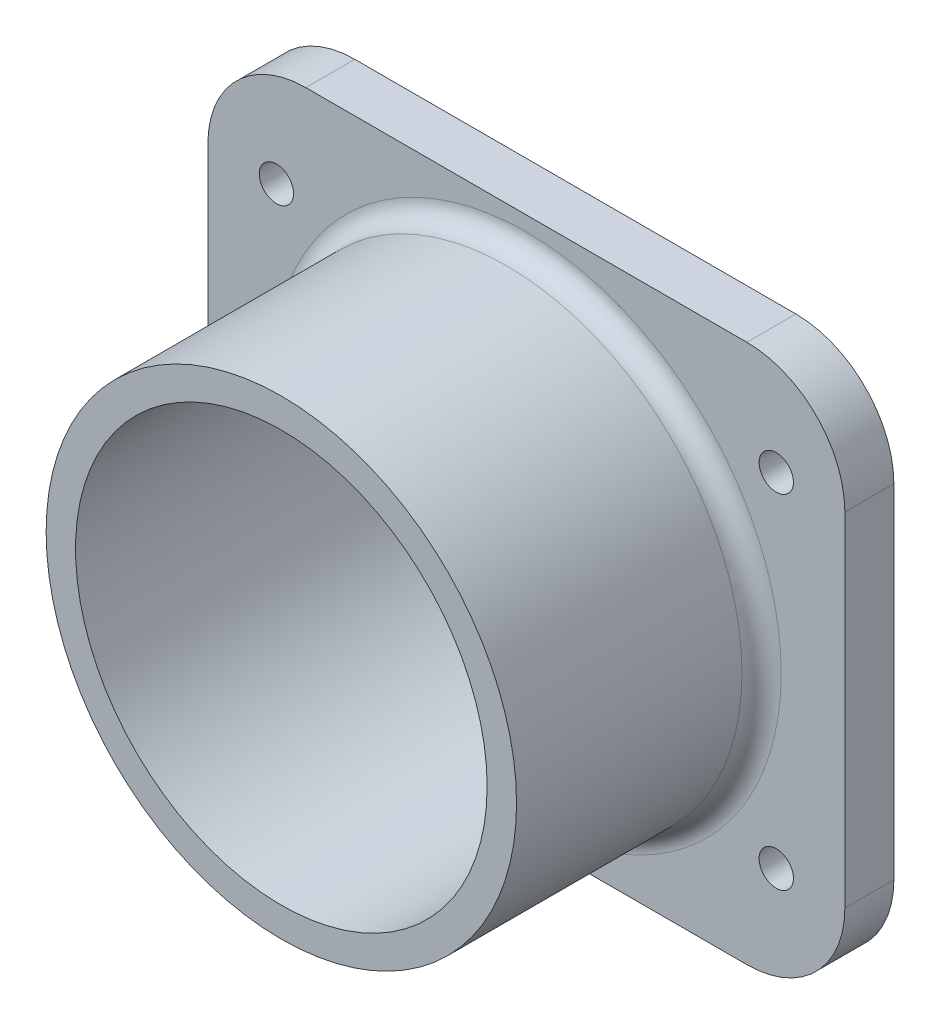
ISO-10303-21;
HEADER;
FILE_DESCRIPTION(('STEP AP214'),'2;1');
FILE_NAME('part.step','',(''),(''),'','','');
FILE_SCHEMA(('AUTOMOTIVE_DESIGN { 1 0 10303 214 1 1 1 1 }'));
ENDSEC;
DATA;
#1=APPLICATION_CONTEXT('core data for automotive mechanical design processes');
#2=APPLICATION_PROTOCOL_DEFINITION('international standard','automotive_design',2000,#1);
#3=PRODUCT_CONTEXT('',#1,'mechanical');
#4=PRODUCT('Part','Part','',(#3));
#5=PRODUCT_RELATED_PRODUCT_CATEGORY('part','',(#4));
#6=PRODUCT_DEFINITION_FORMATION('','',#4);
#7=PRODUCT_DEFINITION_CONTEXT('part definition',#1,'design');
#8=PRODUCT_DEFINITION('design','',#6,#7);
#9=PRODUCT_DEFINITION_SHAPE('','',#8);
#10=(LENGTH_UNIT() NAMED_UNIT(*) SI_UNIT(.MILLI.,.METRE.));
#11=(NAMED_UNIT(*) PLANE_ANGLE_UNIT() SI_UNIT($,.RADIAN.));
#12=(NAMED_UNIT(*) SI_UNIT($,.STERADIAN.) SOLID_ANGLE_UNIT());
#13=UNCERTAINTY_MEASURE_WITH_UNIT(LENGTH_MEASURE(1.E-05),#10,'distance_accuracy_value','');
#14=(GEOMETRIC_REPRESENTATION_CONTEXT(3) GLOBAL_UNCERTAINTY_ASSIGNED_CONTEXT((#13)) GLOBAL_UNIT_ASSIGNED_CONTEXT((#10,
#11,#12)) REPRESENTATION_CONTEXT('',''));
#15=CARTESIAN_POINT('',(0.,0.,0.));
#16=DIRECTION('',(0.,0.,1.));
#17=DIRECTION('',(1.,0.,0.));
#18=AXIS2_PLACEMENT_3D('',#15,#16,#17);
#19=CARTESIAN_POINT('',(0.,0.,5.));
#20=DIRECTION('',(0.,0.,1.));
#21=DIRECTION('',(1.,0.,0.));
#22=AXIS2_PLACEMENT_3D('',#19,#20,#21);
#23=PLANE('',#22);
#24=CARTESIAN_POINT('',(0.,0.,5.));
#25=DIRECTION('',(0.,0.,1.));
#26=DIRECTION('',(1.,0.,0.));
#27=AXIS2_PLACEMENT_3D('',#24,#25,#26);
#28=CIRCLE('',#27,26.);
#29=CARTESIAN_POINT('',(26.,0.,5.));
#30=VERTEX_POINT('',#29);
#31=EDGE_CURVE('E11',#30,#30,#28,.F.);
#32=ORIENTED_EDGE('',*,*,#31,.T.);
#33=EDGE_LOOP('',(#32));
#34=FACE_BOUND('',#33,.T.);
#35=CARTESIAN_POINT('',(-25.5,17.5,5.));
#36=DIRECTION('',(0.,0.,1.));
#37=DIRECTION('',(-1.,0.,0.));
#38=AXIS2_PLACEMENT_3D('',#35,#36,#37);
#39=CIRCLE('',#38,1.75);
#40=CARTESIAN_POINT('',(-27.25,17.5,5.));
#41=VERTEX_POINT('',#40);
#42=EDGE_CURVE('E168',#41,#41,#39,.T.);
#43=ORIENTED_EDGE('',*,*,#42,.F.);
#44=EDGE_LOOP('',(#43));
#45=FACE_BOUND('',#44,.T.);
#46=CARTESIAN_POINT('',(25.5,17.5,5.));
#47=DIRECTION('',(0.,0.,1.));
#48=DIRECTION('',(1.,0.,0.));
#49=AXIS2_PLACEMENT_3D('',#46,#47,#48);
#50=CIRCLE('',#49,1.75);
#51=CARTESIAN_POINT('',(27.25,17.5,5.));
#52=VERTEX_POINT('',#51);
#53=EDGE_CURVE('E288',#52,#52,#50,.T.);
#54=ORIENTED_EDGE('',*,*,#53,.F.);
#55=EDGE_LOOP('',(#54));
#56=FACE_BOUND('',#55,.T.);
#57=CARTESIAN_POINT('',(25.5,-17.5,5.));
#58=DIRECTION('',(0.,0.,1.));
#59=DIRECTION('',(-1.,0.,0.));
#60=AXIS2_PLACEMENT_3D('',#57,#58,#59);
#61=CIRCLE('',#60,1.75);
#62=CARTESIAN_POINT('',(23.75,-17.5,5.));
#63=VERTEX_POINT('',#62);
#64=EDGE_CURVE('E285',#63,#63,#61,.T.);
#65=ORIENTED_EDGE('',*,*,#64,.F.);
#66=EDGE_LOOP('',(#65));
#67=FACE_BOUND('',#66,.T.);
#68=CARTESIAN_POINT('',(-25.5,-17.5,5.));
#69=DIRECTION('',(0.,0.,1.));
#70=DIRECTION('',(1.,0.,0.));
#71=AXIS2_PLACEMENT_3D('',#68,#69,#70);
#72=CIRCLE('',#71,1.75);
#73=CARTESIAN_POINT('',(-23.75,-17.5,5.));
#74=VERTEX_POINT('',#73);
#75=EDGE_CURVE('E163',#74,#74,#72,.T.);
#76=ORIENTED_EDGE('',*,*,#75,.F.);
#77=EDGE_LOOP('',(#76));
#78=FACE_BOUND('',#77,.T.);
#79=DIRECTION('',(0.,-1.,0.));
#80=VECTOR('',#79,1.);
#81=CARTESIAN_POINT('',(32.5,-27.5,5.));
#82=LINE('',#81,#80);
#83=CARTESIAN_POINT('',(32.5,17.5,5.));
#84=VERTEX_POINT('',#83);
#85=CARTESIAN_POINT('',(32.5,-17.5,5.));
#86=VERTEX_POINT('',#85);
#87=EDGE_CURVE('E122',#84,#86,#82,.T.);
#88=ORIENTED_EDGE('',*,*,#87,.F.);
#89=CARTESIAN_POINT('',(22.5,17.5,5.));
#90=DIRECTION('',(0.,0.,1.));
#91=DIRECTION('',(1.,0.,0.));
#92=AXIS2_PLACEMENT_3D('',#89,#90,#91);
#93=CIRCLE('',#92,10.);
#94=CARTESIAN_POINT('',(22.5,27.5,5.));
#95=VERTEX_POINT('',#94);
#96=EDGE_CURVE('E149',#84,#95,#93,.T.);
#97=ORIENTED_EDGE('',*,*,#96,.T.);
#98=DIRECTION('',(1.,0.,0.));
#99=VECTOR('',#98,1.);
#100=CARTESIAN_POINT('',(-32.5,27.5,5.));
#101=LINE('',#100,#99);
#102=CARTESIAN_POINT('',(-22.5,27.5,5.));
#103=VERTEX_POINT('',#102);
#104=EDGE_CURVE('E129',#103,#95,#101,.T.);
#105=ORIENTED_EDGE('',*,*,#104,.F.);
#106=CARTESIAN_POINT('',(-22.5,17.5,5.));
#107=DIRECTION('',(0.,0.,1.));
#108=DIRECTION('',(1.,0.,0.));
#109=AXIS2_PLACEMENT_3D('',#106,#107,#108);
#110=CIRCLE('',#109,10.);
#111=CARTESIAN_POINT('',(-32.5,17.5,5.));
#112=VERTEX_POINT('',#111);
#113=EDGE_CURVE('E52',#103,#112,#110,.T.);
#114=ORIENTED_EDGE('',*,*,#113,.T.);
#115=DIRECTION('',(0.,1.,0.));
#116=VECTOR('',#115,1.);
#117=CARTESIAN_POINT('',(-32.5,-27.5,5.));
#118=LINE('',#117,#116);
#119=CARTESIAN_POINT('',(-32.5,-17.5,5.));
#120=VERTEX_POINT('',#119);
#121=EDGE_CURVE('E266',#120,#112,#118,.T.);
#122=ORIENTED_EDGE('',*,*,#121,.F.);
#123=CARTESIAN_POINT('',(-22.5,-17.5,5.));
#124=DIRECTION('',(0.,0.,1.));
#125=DIRECTION('',(1.,0.,0.));
#126=AXIS2_PLACEMENT_3D('',#123,#124,#125);
#127=CIRCLE('',#126,10.);
#128=CARTESIAN_POINT('',(-22.5,-27.5,5.));
#129=VERTEX_POINT('',#128);
#130=EDGE_CURVE('E145',#120,#129,#127,.T.);
#131=ORIENTED_EDGE('',*,*,#130,.T.);
#132=DIRECTION('',(-1.,0.,0.));
#133=VECTOR('',#132,1.);
#134=CARTESIAN_POINT('',(-32.5,-27.5,5.));
#135=LINE('',#134,#133);
#136=CARTESIAN_POINT('',(22.5,-27.5,5.));
#137=VERTEX_POINT('',#136);
#138=EDGE_CURVE('E263',#137,#129,#135,.T.);
#139=ORIENTED_EDGE('',*,*,#138,.F.);
#140=CARTESIAN_POINT('',(22.5,-17.5,5.));
#141=DIRECTION('',(0.,0.,1.));
#142=DIRECTION('',(1.,0.,0.));
#143=AXIS2_PLACEMENT_3D('',#140,#141,#142);
#144=CIRCLE('',#143,10.);
#145=EDGE_CURVE('E147',#137,#86,#144,.T.);
#146=ORIENTED_EDGE('',*,*,#145,.T.);
#147=EDGE_LOOP('',(#88,#97,#105,#114,#122,#131,#139,#146));
#148=FACE_BOUND('',#147,.T.);
#149=ADVANCED_FACE('F37',(#34,#45,#56,#67,#78,#148),#23,.T.);
#150=CARTESIAN_POINT('',(0.,0.,30.));
#151=DIRECTION('',(0.,0.,-1.));
#152=DIRECTION('',(-1.,0.,0.));
#153=AXIS2_PLACEMENT_3D('',#150,#151,#152);
#154=CYLINDRICAL_SURFACE('',#153,24.);
#155=CARTESIAN_POINT('',(0.,0.,7.));
#156=DIRECTION('',(0.,0.,1.));
#157=DIRECTION('',(1.,0.,0.));
#158=AXIS2_PLACEMENT_3D('',#155,#156,#157);
#159=CIRCLE('',#158,24.);
#160=CARTESIAN_POINT('',(24.,0.,7.));
#161=VERTEX_POINT('',#160);
#162=EDGE_CURVE('E45',#161,#161,#159,.T.);
#163=ORIENTED_EDGE('',*,*,#162,.T.);
#164=EDGE_LOOP('',(#163));
#165=FACE_BOUND('',#164,.T.);
#166=CARTESIAN_POINT('',(0.,0.,30.));
#167=DIRECTION('',(0.,0.,1.));
#168=DIRECTION('',(1.,0.,0.));
#169=AXIS2_PLACEMENT_3D('',#166,#167,#168);
#170=CIRCLE('',#169,24.);
#171=CARTESIAN_POINT('',(24.,0.,30.));
#172=VERTEX_POINT('',#171);
#173=EDGE_CURVE('E125',#172,#172,#170,.T.);
#174=ORIENTED_EDGE('',*,*,#173,.F.);
#175=EDGE_LOOP('',(#174));
#176=FACE_BOUND('',#175,.T.);
#177=ADVANCED_FACE('F176',(#165,#176),#154,.T.);
#178=CARTESIAN_POINT('',(0.,0.,30.));
#179=DIRECTION('',(0.,0.,1.));
#180=DIRECTION('',(1.,0.,0.));
#181=AXIS2_PLACEMENT_3D('',#178,#179,#180);
#182=PLANE('',#181);
#183=CARTESIAN_POINT('',(0.,0.,30.));
#184=DIRECTION('',(0.,0.,1.));
#185=DIRECTION('',(1.,0.,0.));
#186=AXIS2_PLACEMENT_3D('',#183,#184,#185);
#187=CIRCLE('',#186,21.);
#188=CARTESIAN_POINT('',(21.,0.,30.));
#189=VERTEX_POINT('',#188);
#190=EDGE_CURVE('E162',#189,#189,#187,.T.);
#191=ORIENTED_EDGE('',*,*,#190,.F.);
#192=EDGE_LOOP('',(#191));
#193=FACE_BOUND('',#192,.T.);
#194=ORIENTED_EDGE('',*,*,#173,.T.);
#195=EDGE_LOOP('',(#194));
#196=FACE_BOUND('',#195,.T.);
#197=ADVANCED_FACE('F195',(#193,#196),#182,.T.);
#198=CARTESIAN_POINT('',(-32.5,27.5,5.));
#199=DIRECTION('',(0.,1.,0.));
#200=DIRECTION('',(0.,0.,1.));
#201=AXIS2_PLACEMENT_3D('',#198,#199,#200);
#202=PLANE('',#201);
#203=ORIENTED_EDGE('',*,*,#104,.T.);
#204=DIRECTION('',(0.,0.,-1.));
#205=VECTOR('',#204,1.);
#206=CARTESIAN_POINT('',(22.5,27.5,5.));
#207=LINE('',#206,#205);
#208=CARTESIAN_POINT('',(22.5,27.5,0.));
#209=VERTEX_POINT('',#208);
#210=EDGE_CURVE('E114',#95,#209,#207,.T.);
#211=ORIENTED_EDGE('',*,*,#210,.T.);
#212=DIRECTION('',(1.,0.,0.));
#213=VECTOR('',#212,1.);
#214=CARTESIAN_POINT('',(-32.5,27.5,0.));
#215=LINE('',#214,#213);
#216=CARTESIAN_POINT('',(-22.5,27.5,0.));
#217=VERTEX_POINT('',#216);
#218=EDGE_CURVE('E107',#217,#209,#215,.T.);
#219=ORIENTED_EDGE('',*,*,#218,.F.);
#220=DIRECTION('',(0.,0.,-1.));
#221=VECTOR('',#220,1.);
#222=CARTESIAN_POINT('',(-22.5,27.5,5.));
#223=LINE('',#222,#221);
#224=EDGE_CURVE('E120',#217,#103,#223,.F.);
#225=ORIENTED_EDGE('',*,*,#224,.T.);
#226=EDGE_LOOP('',(#203,#211,#219,#225));
#227=FACE_BOUND('',#226,.T.);
#228=ADVANCED_FACE('F119',(#227),#202,.T.);
#229=CARTESIAN_POINT('',(-32.5,-27.5,5.));
#230=DIRECTION('',(0.,-1.,0.));
#231=DIRECTION('',(0.,0.,-1.));
#232=AXIS2_PLACEMENT_3D('',#229,#230,#231);
#233=PLANE('',#232);
#234=DIRECTION('',(-1.,0.,0.));
#235=VECTOR('',#234,1.);
#236=CARTESIAN_POINT('',(-32.5,-27.5,0.));
#237=LINE('',#236,#235);
#238=CARTESIAN_POINT('',(22.5,-27.5,0.));
#239=VERTEX_POINT('',#238);
#240=CARTESIAN_POINT('',(-22.5,-27.5,0.));
#241=VERTEX_POINT('',#240);
#242=EDGE_CURVE('E271',#239,#241,#237,.T.);
#243=ORIENTED_EDGE('',*,*,#242,.F.);
#244=DIRECTION('',(0.,0.,-1.));
#245=VECTOR('',#244,1.);
#246=CARTESIAN_POINT('',(22.5,-27.5,5.));
#247=LINE('',#246,#245);
#248=EDGE_CURVE('E154',#239,#137,#247,.F.);
#249=ORIENTED_EDGE('',*,*,#248,.T.);
#250=ORIENTED_EDGE('',*,*,#138,.T.);
#251=DIRECTION('',(0.,0.,-1.));
#252=VECTOR('',#251,1.);
#253=CARTESIAN_POINT('',(-22.5,-27.5,5.));
#254=LINE('',#253,#252);
#255=EDGE_CURVE('E151',#129,#241,#254,.T.);
#256=ORIENTED_EDGE('',*,*,#255,.T.);
#257=EDGE_LOOP('',(#243,#249,#250,#256));
#258=FACE_BOUND('',#257,.T.);
#259=ADVANCED_FACE('F238',(#258),#233,.T.);
#260=CARTESIAN_POINT('',(32.5,-27.5,5.));
#261=DIRECTION('',(1.,0.,0.));
#262=DIRECTION('',(0.,0.,-1.));
#263=AXIS2_PLACEMENT_3D('',#260,#261,#262);
#264=PLANE('',#263);
#265=DIRECTION('',(0.,-1.,0.));
#266=VECTOR('',#265,1.);
#267=CARTESIAN_POINT('',(32.5,-27.5,0.));
#268=LINE('',#267,#266);
#269=CARTESIAN_POINT('',(32.5,17.5,0.));
#270=VERTEX_POINT('',#269);
#271=CARTESIAN_POINT('',(32.5,-17.5,0.));
#272=VERTEX_POINT('',#271);
#273=EDGE_CURVE('E257',#270,#272,#268,.T.);
#274=ORIENTED_EDGE('',*,*,#273,.F.);
#275=DIRECTION('',(0.,0.,-1.));
#276=VECTOR('',#275,1.);
#277=CARTESIAN_POINT('',(32.5,17.5,5.));
#278=LINE('',#277,#276);
#279=EDGE_CURVE('E142',#270,#84,#278,.F.);
#280=ORIENTED_EDGE('',*,*,#279,.T.);
#281=ORIENTED_EDGE('',*,*,#87,.T.);
#282=DIRECTION('',(0.,0.,-1.));
#283=VECTOR('',#282,1.);
#284=CARTESIAN_POINT('',(32.5,-17.5,5.));
#285=LINE('',#284,#283);
#286=EDGE_CURVE('E139',#86,#272,#285,.T.);
#287=ORIENTED_EDGE('',*,*,#286,.T.);
#288=EDGE_LOOP('',(#274,#280,#281,#287));
#289=FACE_BOUND('',#288,.T.);
#290=ADVANCED_FACE('F241',(#289),#264,.T.);
#291=CARTESIAN_POINT('',(-32.5,-27.5,5.));
#292=DIRECTION('',(-1.,0.,0.));
#293=DIRECTION('',(0.,0.,1.));
#294=AXIS2_PLACEMENT_3D('',#291,#292,#293);
#295=PLANE('',#294);
#296=DIRECTION('',(0.,1.,0.));
#297=VECTOR('',#296,1.);
#298=CARTESIAN_POINT('',(-32.5,-27.5,0.));
#299=LINE('',#298,#297);
#300=CARTESIAN_POINT('',(-32.5,-17.5,0.));
#301=VERTEX_POINT('',#300);
#302=CARTESIAN_POINT('',(-32.5,17.5,0.));
#303=VERTEX_POINT('',#302);
#304=EDGE_CURVE('E108',#301,#303,#299,.T.);
#305=ORIENTED_EDGE('',*,*,#304,.F.);
#306=DIRECTION('',(0.,0.,-1.));
#307=VECTOR('',#306,1.);
#308=CARTESIAN_POINT('',(-32.5,-17.5,5.));
#309=LINE('',#308,#307);
#310=EDGE_CURVE('E59',#301,#120,#309,.F.);
#311=ORIENTED_EDGE('',*,*,#310,.T.);
#312=ORIENTED_EDGE('',*,*,#121,.T.);
#313=DIRECTION('',(0.,0.,-1.));
#314=VECTOR('',#313,1.);
#315=CARTESIAN_POINT('',(-32.5,17.5,5.));
#316=LINE('',#315,#314);
#317=EDGE_CURVE('E156',#112,#303,#316,.T.);
#318=ORIENTED_EDGE('',*,*,#317,.T.);
#319=EDGE_LOOP('',(#305,#311,#312,#318));
#320=FACE_BOUND('',#319,.T.);
#321=ADVANCED_FACE('F203',(#320),#295,.T.);
#322=CARTESIAN_POINT('',(0.,0.,0.));
#323=DIRECTION('',(0.,0.,1.));
#324=DIRECTION('',(1.,0.,0.));
#325=AXIS2_PLACEMENT_3D('',#322,#323,#324);
#326=PLANE('',#325);
#327=CARTESIAN_POINT('',(-25.5,17.5,0.));
#328=DIRECTION('',(0.,0.,1.));
#329=DIRECTION('',(1.,0.,0.));
#330=AXIS2_PLACEMENT_3D('',#327,#328,#329);
#331=CIRCLE('',#330,1.75);
#332=CARTESIAN_POINT('',(-23.75,17.5,0.));
#333=VERTEX_POINT('',#332);
#334=EDGE_CURVE('E171',#333,#333,#331,.T.);
#335=ORIENTED_EDGE('',*,*,#334,.T.);
#336=EDGE_LOOP('',(#335));
#337=FACE_BOUND('',#336,.T.);
#338=CARTESIAN_POINT('',(25.5,17.5,0.));
#339=DIRECTION('',(0.,0.,1.));
#340=DIRECTION('',(1.,0.,0.));
#341=AXIS2_PLACEMENT_3D('',#338,#339,#340);
#342=CIRCLE('',#341,1.75);
#343=CARTESIAN_POINT('',(27.25,17.5,0.));
#344=VERTEX_POINT('',#343);
#345=EDGE_CURVE('E167',#344,#344,#342,.T.);
#346=ORIENTED_EDGE('',*,*,#345,.T.);
#347=EDGE_LOOP('',(#346));
#348=FACE_BOUND('',#347,.T.);
#349=CARTESIAN_POINT('',(25.5,-17.5,0.));
#350=DIRECTION('',(0.,0.,1.));
#351=DIRECTION('',(1.,0.,0.));
#352=AXIS2_PLACEMENT_3D('',#349,#350,#351);
#353=CIRCLE('',#352,1.75);
#354=CARTESIAN_POINT('',(27.25,-17.5,0.));
#355=VERTEX_POINT('',#354);
#356=EDGE_CURVE('E164',#355,#355,#353,.T.);
#357=ORIENTED_EDGE('',*,*,#356,.T.);
#358=EDGE_LOOP('',(#357));
#359=FACE_BOUND('',#358,.T.);
#360=CARTESIAN_POINT('',(-25.5,-17.5,0.));
#361=DIRECTION('',(0.,0.,1.));
#362=DIRECTION('',(1.,0.,0.));
#363=AXIS2_PLACEMENT_3D('',#360,#361,#362);
#364=CIRCLE('',#363,1.75);
#365=CARTESIAN_POINT('',(-23.75,-17.5,0.));
#366=VERTEX_POINT('',#365);
#367=EDGE_CURVE('E159',#366,#366,#364,.T.);
#368=ORIENTED_EDGE('',*,*,#367,.T.);
#369=EDGE_LOOP('',(#368));
#370=FACE_BOUND('',#369,.T.);
#371=CARTESIAN_POINT('',(0.,0.,0.));
#372=DIRECTION('',(0.,0.,1.));
#373=DIRECTION('',(1.,0.,0.));
#374=AXIS2_PLACEMENT_3D('',#371,#372,#373);
#375=CIRCLE('',#374,21.);
#376=CARTESIAN_POINT('',(21.,0.,0.));
#377=VERTEX_POINT('',#376);
#378=EDGE_CURVE('E132',#377,#377,#375,.T.);
#379=ORIENTED_EDGE('',*,*,#378,.T.);
#380=EDGE_LOOP('',(#379));
#381=FACE_BOUND('',#380,.T.);
#382=ORIENTED_EDGE('',*,*,#218,.T.);
#383=CARTESIAN_POINT('',(22.5,17.5,0.));
#384=DIRECTION('',(0.,0.,1.));
#385=DIRECTION('',(1.,0.,0.));
#386=AXIS2_PLACEMENT_3D('',#383,#384,#385);
#387=CIRCLE('',#386,10.);
#388=EDGE_CURVE('E137',#209,#270,#387,.F.);
#389=ORIENTED_EDGE('',*,*,#388,.T.);
#390=ORIENTED_EDGE('',*,*,#273,.T.);
#391=CARTESIAN_POINT('',(22.5,-17.5,0.));
#392=DIRECTION('',(0.,0.,1.));
#393=DIRECTION('',(1.,0.,0.));
#394=AXIS2_PLACEMENT_3D('',#391,#392,#393);
#395=CIRCLE('',#394,10.);
#396=EDGE_CURVE('E135',#272,#239,#395,.F.);
#397=ORIENTED_EDGE('',*,*,#396,.T.);
#398=ORIENTED_EDGE('',*,*,#242,.T.);
#399=CARTESIAN_POINT('',(-22.5,-17.5,0.));
#400=DIRECTION('',(0.,0.,1.));
#401=DIRECTION('',(1.,0.,0.));
#402=AXIS2_PLACEMENT_3D('',#399,#400,#401);
#403=CIRCLE('',#402,10.);
#404=EDGE_CURVE('E113',#241,#301,#403,.F.);
#405=ORIENTED_EDGE('',*,*,#404,.T.);
#406=ORIENTED_EDGE('',*,*,#304,.T.);
#407=CARTESIAN_POINT('',(-22.5,17.5,0.));
#408=DIRECTION('',(0.,0.,1.));
#409=DIRECTION('',(1.,0.,0.));
#410=AXIS2_PLACEMENT_3D('',#407,#408,#409);
#411=CIRCLE('',#410,10.);
#412=EDGE_CURVE('E104',#303,#217,#411,.F.);
#413=ORIENTED_EDGE('',*,*,#412,.T.);
#414=EDGE_LOOP('',(#382,#389,#390,#397,#398,#405,#406,#413));
#415=FACE_BOUND('',#414,.T.);
#416=ADVANCED_FACE('F106',(#337,#348,#359,#370,#381,#415),#326,.F.);
#417=CARTESIAN_POINT('',(0.,0.,-29.));
#418=DIRECTION('',(0.,0.,1.));
#419=DIRECTION('',(1.,0.,0.));
#420=AXIS2_PLACEMENT_3D('',#417,#418,#419);
#421=CYLINDRICAL_SURFACE('',#420,21.);
#422=ORIENTED_EDGE('',*,*,#190,.T.);
#423=EDGE_LOOP('',(#422));
#424=FACE_BOUND('',#423,.T.);
#425=ORIENTED_EDGE('',*,*,#378,.F.);
#426=EDGE_LOOP('',(#425));
#427=FACE_BOUND('',#426,.T.);
#428=ADVANCED_FACE('F202',(#424,#427),#421,.F.);
#429=CARTESIAN_POINT('',(22.5,17.5,5.));
#430=DIRECTION('',(0.,0.,-1.));
#431=DIRECTION('',(-1.,0.,0.));
#432=AXIS2_PLACEMENT_3D('',#429,#430,#431);
#433=CYLINDRICAL_SURFACE('',#432,10.);
#434=ORIENTED_EDGE('',*,*,#96,.F.);
#435=ORIENTED_EDGE('',*,*,#279,.F.);
#436=ORIENTED_EDGE('',*,*,#388,.F.);
#437=ORIENTED_EDGE('',*,*,#210,.F.);
#438=EDGE_LOOP('',(#434,#435,#436,#437));
#439=FACE_BOUND('',#438,.T.);
#440=ADVANCED_FACE('F205',(#439),#433,.T.);
#441=CARTESIAN_POINT('',(22.5,-17.5,5.));
#442=DIRECTION('',(0.,0.,-1.));
#443=DIRECTION('',(-1.,0.,0.));
#444=AXIS2_PLACEMENT_3D('',#441,#442,#443);
#445=CYLINDRICAL_SURFACE('',#444,10.);
#446=ORIENTED_EDGE('',*,*,#145,.F.);
#447=ORIENTED_EDGE('',*,*,#248,.F.);
#448=ORIENTED_EDGE('',*,*,#396,.F.);
#449=ORIENTED_EDGE('',*,*,#286,.F.);
#450=EDGE_LOOP('',(#446,#447,#448,#449));
#451=FACE_BOUND('',#450,.T.);
#452=ADVANCED_FACE('F208',(#451),#445,.T.);
#453=CARTESIAN_POINT('',(-22.5,-17.5,5.));
#454=DIRECTION('',(0.,0.,-1.));
#455=DIRECTION('',(-1.,0.,0.));
#456=AXIS2_PLACEMENT_3D('',#453,#454,#455);
#457=CYLINDRICAL_SURFACE('',#456,10.);
#458=ORIENTED_EDGE('',*,*,#130,.F.);
#459=ORIENTED_EDGE('',*,*,#310,.F.);
#460=ORIENTED_EDGE('',*,*,#404,.F.);
#461=ORIENTED_EDGE('',*,*,#255,.F.);
#462=EDGE_LOOP('',(#458,#459,#460,#461));
#463=FACE_BOUND('',#462,.T.);
#464=ADVANCED_FACE('F212',(#463),#457,.T.);
#465=CARTESIAN_POINT('',(-22.5,17.5,5.));
#466=DIRECTION('',(0.,0.,-1.));
#467=DIRECTION('',(-1.,0.,0.));
#468=AXIS2_PLACEMENT_3D('',#465,#466,#467);
#469=CYLINDRICAL_SURFACE('',#468,10.);
#470=ORIENTED_EDGE('',*,*,#113,.F.);
#471=ORIENTED_EDGE('',*,*,#224,.F.);
#472=ORIENTED_EDGE('',*,*,#412,.F.);
#473=ORIENTED_EDGE('',*,*,#317,.F.);
#474=EDGE_LOOP('',(#470,#471,#472,#473));
#475=FACE_BOUND('',#474,.T.);
#476=ADVANCED_FACE('F124',(#475),#469,.T.);
#477=CARTESIAN_POINT('',(-25.5,-17.5,-5.));
#478=DIRECTION('',(0.,0.,1.));
#479=DIRECTION('',(1.,0.,0.));
#480=AXIS2_PLACEMENT_3D('',#477,#478,#479);
#481=CYLINDRICAL_SURFACE('',#480,1.75);
#482=ORIENTED_EDGE('',*,*,#75,.T.);
#483=EDGE_LOOP('',(#482));
#484=FACE_BOUND('',#483,.T.);
#485=ORIENTED_EDGE('',*,*,#367,.F.);
#486=EDGE_LOOP('',(#485));
#487=FACE_BOUND('',#486,.T.);
#488=ADVANCED_FACE('F217',(#484,#487),#481,.F.);
#489=CARTESIAN_POINT('',(25.5,-17.5,-5.));
#490=DIRECTION('',(0.,0.,1.));
#491=DIRECTION('',(1.,0.,0.));
#492=AXIS2_PLACEMENT_3D('',#489,#490,#491);
#493=CYLINDRICAL_SURFACE('',#492,1.75);
#494=ORIENTED_EDGE('',*,*,#64,.T.);
#495=EDGE_LOOP('',(#494));
#496=FACE_BOUND('',#495,.T.);
#497=ORIENTED_EDGE('',*,*,#356,.F.);
#498=EDGE_LOOP('',(#497));
#499=FACE_BOUND('',#498,.T.);
#500=ADVANCED_FACE('F221',(#496,#499),#493,.F.);
#501=CARTESIAN_POINT('',(25.5,17.5,-5.));
#502=DIRECTION('',(0.,0.,1.));
#503=DIRECTION('',(1.,0.,0.));
#504=AXIS2_PLACEMENT_3D('',#501,#502,#503);
#505=CYLINDRICAL_SURFACE('',#504,1.75);
#506=ORIENTED_EDGE('',*,*,#53,.T.);
#507=EDGE_LOOP('',(#506));
#508=FACE_BOUND('',#507,.T.);
#509=ORIENTED_EDGE('',*,*,#345,.F.);
#510=EDGE_LOOP('',(#509));
#511=FACE_BOUND('',#510,.T.);
#512=ADVANCED_FACE('F185',(#508,#511),#505,.F.);
#513=CARTESIAN_POINT('',(-25.5,17.5,-5.));
#514=DIRECTION('',(0.,0.,1.));
#515=DIRECTION('',(1.,0.,0.));
#516=AXIS2_PLACEMENT_3D('',#513,#514,#515);
#517=CYLINDRICAL_SURFACE('',#516,1.75);
#518=ORIENTED_EDGE('',*,*,#42,.T.);
#519=EDGE_LOOP('',(#518));
#520=FACE_BOUND('',#519,.T.);
#521=ORIENTED_EDGE('',*,*,#334,.F.);
#522=EDGE_LOOP('',(#521));
#523=FACE_BOUND('',#522,.T.);
#524=ADVANCED_FACE('F180',(#520,#523),#517,.F.);
#525=CARTESIAN_POINT('',(0.,0.,7.));
#526=DIRECTION('',(0.,0.,1.));
#527=DIRECTION('',(1.,0.,0.));
#528=AXIS2_PLACEMENT_3D('',#525,#526,#527);
#529=TOROIDAL_SURFACE('',#528,26.,2.);
#530=ORIENTED_EDGE('',*,*,#31,.F.);
#531=EDGE_LOOP('',(#530));
#532=FACE_BOUND('',#531,.T.);
#533=ORIENTED_EDGE('',*,*,#162,.F.);
#534=EDGE_LOOP('',(#533));
#535=FACE_BOUND('',#534,.T.);
#536=ADVANCED_FACE('F39',(#532,#535),#529,.F.);
#537=CLOSED_SHELL('',(#149,#177,#197,#228,#259,#290,#321,#416,#428,#440,#452,#464,#476,#488,
#500,#512,#524,#536));
#538=MANIFOLD_SOLID_BREP('B2',#537);
#539=ADVANCED_BREP_SHAPE_REPRESENTATION('',(#18,#538),#14);
#540=SHAPE_DEFINITION_REPRESENTATION(#9,#539);
ENDSEC;
END-ISO-10303-21;
